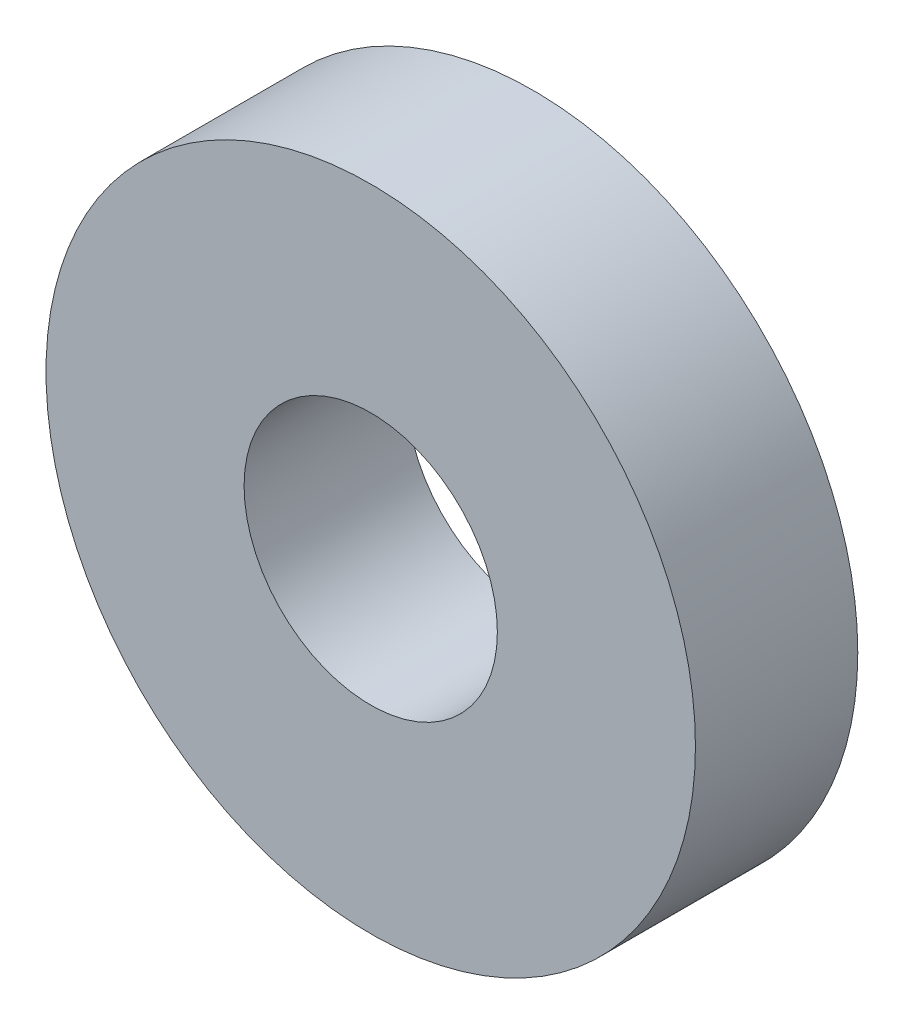
ISO-10303-21;
HEADER;
FILE_DESCRIPTION(('STEP AP214'),'2;1');
FILE_NAME('part.step','',(''),(''),'','','');
FILE_SCHEMA(('AUTOMOTIVE_DESIGN { 1 0 10303 214 1 1 1 1 }'));
ENDSEC;
DATA;
#1=APPLICATION_CONTEXT('core data for automotive mechanical design processes');
#2=APPLICATION_PROTOCOL_DEFINITION('international standard','automotive_design',2000,#1);
#3=PRODUCT_CONTEXT('',#1,'mechanical');
#4=PRODUCT('Part','Part','',(#3));
#5=PRODUCT_RELATED_PRODUCT_CATEGORY('part','',(#4));
#6=PRODUCT_DEFINITION_FORMATION('','',#4);
#7=PRODUCT_DEFINITION_CONTEXT('part definition',#1,'design');
#8=PRODUCT_DEFINITION('design','',#6,#7);
#9=PRODUCT_DEFINITION_SHAPE('','',#8);
#10=(LENGTH_UNIT() NAMED_UNIT(*) SI_UNIT(.MILLI.,.METRE.));
#11=(NAMED_UNIT(*) PLANE_ANGLE_UNIT() SI_UNIT($,.RADIAN.));
#12=(NAMED_UNIT(*) SI_UNIT($,.STERADIAN.) SOLID_ANGLE_UNIT());
#13=UNCERTAINTY_MEASURE_WITH_UNIT(LENGTH_MEASURE(1.E-05),#10,'distance_accuracy_value','');
#14=(GEOMETRIC_REPRESENTATION_CONTEXT(3) GLOBAL_UNCERTAINTY_ASSIGNED_CONTEXT((#13)) GLOBAL_UNIT_ASSIGNED_CONTEXT((#10,
#11,#12)) REPRESENTATION_CONTEXT('',''));
#15=CARTESIAN_POINT('',(0.,0.,0.));
#16=DIRECTION('',(0.,0.,1.));
#17=DIRECTION('',(1.,0.,0.));
#18=AXIS2_PLACEMENT_3D('',#15,#16,#17);
#19=CARTESIAN_POINT('',(0.,0.,5.));
#20=DIRECTION('',(0.,0.,1.));
#21=DIRECTION('',(1.,0.,0.));
#22=AXIS2_PLACEMENT_3D('',#19,#20,#21);
#23=PLANE('',#22);
#24=CARTESIAN_POINT('',(0.,0.,5.));
#25=DIRECTION('',(0.,0.,1.));
#26=DIRECTION('',(1.,0.,0.));
#27=AXIS2_PLACEMENT_3D('',#24,#25,#26);
#28=CIRCLE('',#27,10.);
#29=CARTESIAN_POINT('',(10.,0.,5.));
#30=VERTEX_POINT('',#29);
#31=EDGE_CURVE('E10',#30,#30,#28,.T.);
#32=ORIENTED_EDGE('',*,*,#31,.T.);
#33=EDGE_LOOP('',(#32));
#34=FACE_BOUND('',#33,.T.);
#35=CARTESIAN_POINT('',(0.,0.,5.));
#36=DIRECTION('',(0.,0.,1.));
#37=DIRECTION('',(1.,0.,0.));
#38=AXIS2_PLACEMENT_3D('',#35,#36,#37);
#39=CIRCLE('',#38,3.9);
#40=CARTESIAN_POINT('',(3.9,0.,5.));
#41=VERTEX_POINT('',#40);
#42=EDGE_CURVE('E41',#41,#41,#39,.T.);
#43=ORIENTED_EDGE('',*,*,#42,.F.);
#44=EDGE_LOOP('',(#43));
#45=FACE_BOUND('',#44,.T.);
#46=ADVANCED_FACE('F30',(#34,#45),#23,.T.);
#47=CARTESIAN_POINT('',(0.,0.,0.));
#48=DIRECTION('',(0.,0.,1.));
#49=DIRECTION('',(1.,0.,0.));
#50=AXIS2_PLACEMENT_3D('',#47,#48,#49);
#51=PLANE('',#50);
#52=CARTESIAN_POINT('',(0.,0.,0.));
#53=DIRECTION('',(0.,0.,1.));
#54=DIRECTION('',(1.,0.,0.));
#55=AXIS2_PLACEMENT_3D('',#52,#53,#54);
#56=CIRCLE('',#55,10.);
#57=CARTESIAN_POINT('',(10.,0.,0.));
#58=VERTEX_POINT('',#57);
#59=EDGE_CURVE('E34',#58,#58,#56,.T.);
#60=ORIENTED_EDGE('',*,*,#59,.F.);
#61=EDGE_LOOP('',(#60));
#62=FACE_BOUND('',#61,.T.);
#63=CARTESIAN_POINT('',(0.,0.,0.));
#64=DIRECTION('',(0.,0.,1.));
#65=DIRECTION('',(1.,0.,0.));
#66=AXIS2_PLACEMENT_3D('',#63,#64,#65);
#67=CIRCLE('',#66,3.9);
#68=CARTESIAN_POINT('',(3.9,0.,0.));
#69=VERTEX_POINT('',#68);
#70=EDGE_CURVE('E43',#69,#69,#67,.T.);
#71=ORIENTED_EDGE('',*,*,#70,.T.);
#72=EDGE_LOOP('',(#71));
#73=FACE_BOUND('',#72,.T.);
#74=ADVANCED_FACE('F53',(#62,#73),#51,.F.);
#75=CARTESIAN_POINT('',(0.,0.,5.));
#76=DIRECTION('',(0.,0.,-1.));
#77=DIRECTION('',(-1.,0.,0.));
#78=AXIS2_PLACEMENT_3D('',#75,#76,#77);
#79=CYLINDRICAL_SURFACE('',#78,10.);
#80=ORIENTED_EDGE('',*,*,#31,.F.);
#81=EDGE_LOOP('',(#80));
#82=FACE_BOUND('',#81,.T.);
#83=ORIENTED_EDGE('',*,*,#59,.T.);
#84=EDGE_LOOP('',(#83));
#85=FACE_BOUND('',#84,.T.);
#86=ADVANCED_FACE('F32',(#82,#85),#79,.T.);
#87=CARTESIAN_POINT('',(0.,0.,5.));
#88=DIRECTION('',(0.,0.,-1.));
#89=DIRECTION('',(-1.,0.,0.));
#90=AXIS2_PLACEMENT_3D('',#87,#88,#89);
#91=CYLINDRICAL_SURFACE('',#90,3.9);
#92=ORIENTED_EDGE('',*,*,#42,.T.);
#93=EDGE_LOOP('',(#92));
#94=FACE_BOUND('',#93,.T.);
#95=ORIENTED_EDGE('',*,*,#70,.F.);
#96=EDGE_LOOP('',(#95));
#97=FACE_BOUND('',#96,.T.);
#98=ADVANCED_FACE('F49',(#94,#97),#91,.F.);
#99=CLOSED_SHELL('',(#46,#74,#86,#98));
#100=MANIFOLD_SOLID_BREP('B2',#99);
#101=ADVANCED_BREP_SHAPE_REPRESENTATION('',(#18,#100),#14);
#102=SHAPE_DEFINITION_REPRESENTATION(#9,#101);
ENDSEC;
END-ISO-10303-21;
